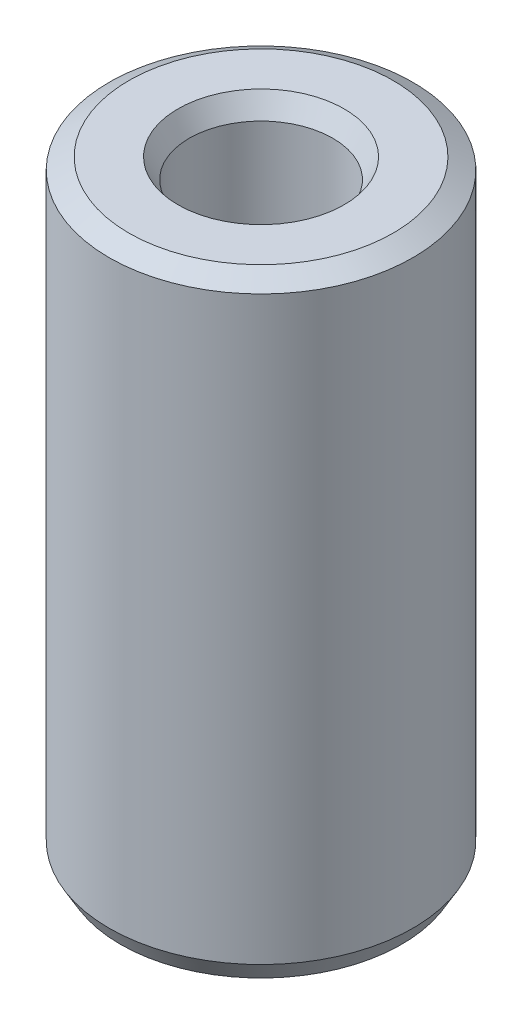
ISO-10303-21;
HEADER;
FILE_DESCRIPTION(('STEP AP214'),'2;1');
FILE_NAME('part.step','',(''),(''),'','','');
FILE_SCHEMA(('AUTOMOTIVE_DESIGN { 1 0 10303 214 1 1 1 1 }'));
ENDSEC;
DATA;
#1=APPLICATION_CONTEXT('core data for automotive mechanical design processes');
#2=APPLICATION_PROTOCOL_DEFINITION('international standard','automotive_design',2000,#1);
#3=PRODUCT_CONTEXT('',#1,'mechanical');
#4=PRODUCT('Part','Part','',(#3));
#5=PRODUCT_RELATED_PRODUCT_CATEGORY('part','',(#4));
#6=PRODUCT_DEFINITION_FORMATION('','',#4);
#7=PRODUCT_DEFINITION_CONTEXT('part definition',#1,'design');
#8=PRODUCT_DEFINITION('design','',#6,#7);
#9=PRODUCT_DEFINITION_SHAPE('','',#8);
#10=(LENGTH_UNIT() NAMED_UNIT(*) SI_UNIT(.MILLI.,.METRE.));
#11=(NAMED_UNIT(*) PLANE_ANGLE_UNIT() SI_UNIT($,.RADIAN.));
#12=(NAMED_UNIT(*) SI_UNIT($,.STERADIAN.) SOLID_ANGLE_UNIT());
#13=UNCERTAINTY_MEASURE_WITH_UNIT(LENGTH_MEASURE(1.E-05),#10,'distance_accuracy_value','');
#14=(GEOMETRIC_REPRESENTATION_CONTEXT(3) GLOBAL_UNCERTAINTY_ASSIGNED_CONTEXT((#13)) GLOBAL_UNIT_ASSIGNED_CONTEXT((#10,
#11,#12)) REPRESENTATION_CONTEXT('',''));
#15=CARTESIAN_POINT('',(0.,0.,0.));
#16=DIRECTION('',(0.,0.,1.));
#17=DIRECTION('',(1.,0.,0.));
#18=AXIS2_PLACEMENT_3D('',#15,#16,#17);
#19=CARTESIAN_POINT('',(0.,201.39709668376,0.));
#20=DIRECTION('',(0.,-1.,0.));
#21=DIRECTION('',(0.,0.,-1.));
#22=AXIS2_PLACEMENT_3D('',#19,#20,#21);
#23=CYLINDRICAL_SURFACE('',#22,50.);
#24=CARTESIAN_POINT('',(0.,6.49599250968244,0.));
#25=DIRECTION('',(0.,1.,0.));
#26=DIRECTION('',(0.,0.,1.));
#27=AXIS2_PLACEMENT_3D('',#24,#25,#26);
#28=CIRCLE('',#27,50.);
#29=CARTESIAN_POINT('',(0.,6.49599250968244,50.));
#30=VERTEX_POINT('',#29);
#31=EDGE_CURVE('E10',#30,#30,#28,.T.);
#32=ORIENTED_EDGE('',*,*,#31,.T.);
#33=EDGE_LOOP('',(#32));
#34=FACE_BOUND('',#33,.T.);
#35=CARTESIAN_POINT('',(0.,197.646633659641,0.));
#36=DIRECTION('',(0.,1.,0.));
#37=DIRECTION('',(0.,0.,1.));
#38=AXIS2_PLACEMENT_3D('',#35,#36,#37);
#39=CIRCLE('',#38,50.);
#40=CARTESIAN_POINT('',(0.,197.646633659641,50.));
#41=VERTEX_POINT('',#40);
#42=EDGE_CURVE('E50',#41,#41,#39,.F.);
#43=ORIENTED_EDGE('',*,*,#42,.T.);
#44=EDGE_LOOP('',(#43));
#45=FACE_BOUND('',#44,.T.);
#46=ADVANCED_FACE('F39',(#34,#45),#23,.T.);
#47=CARTESIAN_POINT('',(0.,201.39709668376,0.));
#48=DIRECTION('',(0.,1.,0.));
#49=DIRECTION('',(0.,0.,1.));
#50=AXIS2_PLACEMENT_3D('',#47,#48,#49);
#51=PLANE('',#50);
#52=CARTESIAN_POINT('',(0.,201.39709668376,0.));
#53=DIRECTION('',(0.,1.,0.));
#54=DIRECTION('',(0.,0.,1.));
#55=AXIS2_PLACEMENT_3D('',#52,#53,#54);
#56=CIRCLE('',#55,27.3605341539599);
#57=CARTESIAN_POINT('',(0.,201.39709668376,27.3605341539599));
#58=VERTEX_POINT('',#57);
#59=EDGE_CURVE('E58',#58,#58,#56,.F.);
#60=ORIENTED_EDGE('',*,*,#59,.T.);
#61=EDGE_LOOP('',(#60));
#62=FACE_BOUND('',#61,.T.);
#63=CARTESIAN_POINT('',(0.,201.39709668376,0.));
#64=DIRECTION('',(0.,1.,0.));
#65=DIRECTION('',(0.,0.,1.));
#66=AXIS2_PLACEMENT_3D('',#63,#64,#65);
#67=CIRCLE('',#66,43.5040074903174);
#68=CARTESIAN_POINT('',(0.,201.39709668376,43.5040074903174));
#69=VERTEX_POINT('',#68);
#70=EDGE_CURVE('E61',#69,#69,#67,.T.);
#71=ORIENTED_EDGE('',*,*,#70,.T.);
#72=EDGE_LOOP('',(#71));
#73=FACE_BOUND('',#72,.T.);
#74=ADVANCED_FACE('F88',(#62,#73),#51,.T.);
#75=CARTESIAN_POINT('',(0.,0.,0.));
#76=DIRECTION('',(0.,1.,0.));
#77=DIRECTION('',(0.,0.,1.));
#78=AXIS2_PLACEMENT_3D('',#75,#76,#77);
#79=PLANE('',#78);
#80=CARTESIAN_POINT('',(0.,0.,0.));
#81=DIRECTION('',(0.,1.,0.));
#82=DIRECTION('',(0.,0.,1.));
#83=AXIS2_PLACEMENT_3D('',#80,#81,#82);
#84=CIRCLE('',#83,30.1060636395233);
#85=CARTESIAN_POINT('',(0.,0.,-30.1060636395233));
#86=VERTEX_POINT('',#85);
#87=EDGE_CURVE('E51',#86,#86,#84,.T.);
#88=ORIENTED_EDGE('',*,*,#87,.T.);
#89=EDGE_LOOP('',(#88));
#90=FACE_BOUND('',#89,.T.);
#91=CARTESIAN_POINT('',(0.,0.,0.));
#92=DIRECTION('',(0.,1.,0.));
#93=DIRECTION('',(0.,0.,1.));
#94=AXIS2_PLACEMENT_3D('',#91,#92,#93);
#95=CIRCLE('',#94,46.249536975881);
#96=CARTESIAN_POINT('',(0.,0.,46.249536975881));
#97=VERTEX_POINT('',#96);
#98=EDGE_CURVE('E54',#97,#97,#95,.F.);
#99=ORIENTED_EDGE('',*,*,#98,.T.);
#100=EDGE_LOOP('',(#99));
#101=FACE_BOUND('',#100,.T.);
#102=ADVANCED_FACE('F83',(#90,#101),#79,.F.);
#103=CARTESIAN_POINT('',(0.,201.39709668376,0.));
#104=DIRECTION('',(0.,-1.,0.));
#105=DIRECTION('',(0.,0.,-1.));
#106=AXIS2_PLACEMENT_3D('',#103,#104,#105);
#107=CYLINDRICAL_SURFACE('',#106,23.6100711298409);
#108=CARTESIAN_POINT('',(0.,194.901104174077,0.));
#109=DIRECTION('',(0.,1.,0.));
#110=DIRECTION('',(0.,0.,1.));
#111=AXIS2_PLACEMENT_3D('',#108,#109,#110);
#112=CIRCLE('',#111,23.6100711298409);
#113=CARTESIAN_POINT('',(0.,194.901104174077,23.6100711298409));
#114=VERTEX_POINT('',#113);
#115=EDGE_CURVE('E67',#114,#114,#112,.T.);
#116=ORIENTED_EDGE('',*,*,#115,.T.);
#117=EDGE_LOOP('',(#116));
#118=FACE_BOUND('',#117,.T.);
#119=CARTESIAN_POINT('',(0.,3.75046302411899,0.));
#120=DIRECTION('',(0.,1.,0.));
#121=DIRECTION('',(0.,0.,1.));
#122=AXIS2_PLACEMENT_3D('',#119,#120,#121);
#123=CIRCLE('',#122,23.6100711298409);
#124=CARTESIAN_POINT('',(0.,3.75046302411899,-23.6100711298409));
#125=VERTEX_POINT('',#124);
#126=EDGE_CURVE('E69',#125,#125,#123,.F.);
#127=ORIENTED_EDGE('',*,*,#126,.T.);
#128=EDGE_LOOP('',(#127));
#129=FACE_BOUND('',#128,.T.);
#130=ADVANCED_FACE('F71',(#118,#129),#107,.F.);
#131=CARTESIAN_POINT('',(0.,194.901104174077,0.));
#132=DIRECTION('',(0.,1.,0.));
#133=DIRECTION('',(0.,0.,1.));
#134=AXIS2_PLACEMENT_3D('',#131,#132,#133);
#135=CONICAL_SURFACE('',#134,23.6100711298409,0.523598775598299);
#136=ORIENTED_EDGE('',*,*,#59,.F.);
#137=EDGE_LOOP('',(#136));
#138=FACE_BOUND('',#137,.T.);
#139=ORIENTED_EDGE('',*,*,#115,.F.);
#140=EDGE_LOOP('',(#139));
#141=FACE_BOUND('',#140,.T.);
#142=ADVANCED_FACE('F77',(#138,#141),#135,.F.);
#143=CARTESIAN_POINT('',(0.,0.,0.));
#144=DIRECTION('',(0.,-1.,0.));
#145=DIRECTION('',(0.,0.,-1.));
#146=AXIS2_PLACEMENT_3D('',#143,#144,#145);
#147=CONICAL_SURFACE('',#146,30.1060636395233,1.0471975511966);
#148=CARTESIAN_POINT('',(0.,3.75046302411899,-23.6100711298409));
#149=CARTESIAN_POINT('',(0.,3.71139570095109,-23.6777377184834));
#150=CARTESIAN_POINT('',(0.,3.67232837778318,-23.7454043071259));
#151=CARTESIAN_POINT('',(0.,3.59419373144737,-23.880737484411));
#152=CARTESIAN_POINT('',(0.,3.55512640827946,-23.9484040730535));
#153=CARTESIAN_POINT('',(0.,3.47699176194365,-24.0837372503385));
#154=CARTESIAN_POINT('',(0.,3.43792443877574,-24.1514038389811));
#155=CARTESIAN_POINT('',(0.,3.35978979243993,-24.2867370162661));
#156=CARTESIAN_POINT('',(0.,3.32072246927203,-24.3544036049086));
#157=CARTESIAN_POINT('',(0.,3.24258782293621,-24.4897367821937));
#158=CARTESIAN_POINT('',(0.,3.20352049976831,-24.5574033708362));
#159=CARTESIAN_POINT('',(0.,3.12538585343249,-24.6927365481213));
#160=CARTESIAN_POINT('',(0.,3.08631853026459,-24.7604031367638));
#161=CARTESIAN_POINT('',(0.,3.00818388392878,-24.8957363140488));
#162=CARTESIAN_POINT('',(0.,2.96911656076087,-24.9634029026914));
#163=CARTESIAN_POINT('',(0.,2.89098191442506,-25.0987360799764));
#164=CARTESIAN_POINT('',(0.,2.85191459125715,-25.166402668619));
#165=CARTESIAN_POINT('',(0.,2.77377994492134,-25.301735845904));
#166=CARTESIAN_POINT('',(0.,2.73471262175343,-25.3694024345465));
#167=CARTESIAN_POINT('',(0.,2.65657797541762,-25.5047356118316));
#168=CARTESIAN_POINT('',(0.,2.61751065224971,-25.5724022004741));
#169=CARTESIAN_POINT('',(0.,2.5393760059139,-25.7077353777592));
#170=CARTESIAN_POINT('',(0.,2.500308682746,-25.7754019664017));
#171=CARTESIAN_POINT('',(0.,2.42217403641018,-25.9107351436867));
#172=CARTESIAN_POINT('',(0.,2.38310671324228,-25.9784017323293));
#173=CARTESIAN_POINT('',(0.,2.30497206690646,-26.1137349096143));
#174=CARTESIAN_POINT('',(0.,2.26590474373856,-26.1814014982568));
#175=CARTESIAN_POINT('',(0.,2.18777009740275,-26.3167346755419));
#176=CARTESIAN_POINT('',(0.,2.14870277423484,-26.3844012641844));
#177=CARTESIAN_POINT('',(0.,2.07056812789903,-26.5197344414695));
#178=CARTESIAN_POINT('',(0.,2.03150080473112,-26.587401030112));
#179=CARTESIAN_POINT('',(0.,1.95336615839531,-26.722734207397));
#180=CARTESIAN_POINT('',(0.,1.9142988352274,-26.7904007960396));
#181=CARTESIAN_POINT('',(0.,1.83616418889159,-26.9257339733246));
#182=CARTESIAN_POINT('',(0.,1.79709686572368,-26.9934005619671));
#183=CARTESIAN_POINT('',(0.,1.71896221938787,-27.1287337392522));
#184=CARTESIAN_POINT('',(0.,1.67989489621997,-27.1964003278947));
#185=CARTESIAN_POINT('',(0.,1.60176024988415,-27.3317335051798));
#186=CARTESIAN_POINT('',(0.,1.56269292671625,-27.3994000938223));
#187=CARTESIAN_POINT('',(0.,1.48455828038043,-27.5347332711074));
#188=CARTESIAN_POINT('',(0.,1.44549095721253,-27.6023998597499));
#189=CARTESIAN_POINT('',(0.,1.36735631087672,-27.7377330370349));
#190=CARTESIAN_POINT('',(0.,1.32828898770881,-27.8053996256775));
#191=CARTESIAN_POINT('',(0.,1.250154341373,-27.9407328029625));
#192=CARTESIAN_POINT('',(0.,1.21108701820509,-28.008399391605));
#193=CARTESIAN_POINT('',(0.,1.13295237186928,-28.1437325688901));
#194=CARTESIAN_POINT('',(0.,1.09388504870137,-28.2113991575326));
#195=CARTESIAN_POINT('',(0.,1.01575040236556,-28.3467323348177));
#196=CARTESIAN_POINT('',(0.,0.976683079197655,-28.4143989234602));
#197=CARTESIAN_POINT('',(0.,0.898548432861842,-28.5497321007452));
#198=CARTESIAN_POINT('',(0.,0.859481109693936,-28.6173986893878));
#199=CARTESIAN_POINT('',(0.,0.781346463358124,-28.7527318666728));
#200=CARTESIAN_POINT('',(0.,0.742279140190217,-28.8203984553153));
#201=CARTESIAN_POINT('',(0.,0.664144493854405,-28.9557316326004));
#202=CARTESIAN_POINT('',(0.,0.625077170686499,-29.0233982212429));
#203=CARTESIAN_POINT('',(0.,0.546942524350686,-29.158731398528));
#204=CARTESIAN_POINT('',(0.,0.50787520118278,-29.2263979871705));
#205=CARTESIAN_POINT('',(0.,0.429740554846968,-29.3617311644556));
#206=CARTESIAN_POINT('',(0.,0.390673231679062,-29.4293977530981));
#207=CARTESIAN_POINT('',(0.,0.31253858534325,-29.5647309303831));
#208=CARTESIAN_POINT('',(0.,0.273471262175343,-29.6323975190257));
#209=CARTESIAN_POINT('',(0.,0.195336615839531,-29.7677306963107));
#210=CARTESIAN_POINT('',(0.,0.156269292671625,-29.8353972849532));
#211=CARTESIAN_POINT('',(0.,0.0781346463358124,-29.9707304622383));
#212=CARTESIAN_POINT('',(0.,0.0390673231679063,-30.0383970508808));
#213=CARTESIAN_POINT('',(0.,0.,-30.1060636395233));
#214=B_SPLINE_CURVE_WITH_KNOTS('',3,(#148,#149,#150,#151,#152,#153,#154,#155,#156,#157,#158,
#159,#160,#161,#162,#163,#164,#165,#166,#167,#168,#169,#170,#171,#172,#173,#174,#175,#176,#177,
#178,#179,#180,#181,#182,#183,#184,#185,#186,#187,#188,#189,#190,#191,#192,#193,#194,#195,#196,
#197,#198,#199,#200,#201,#202,#203,#204,#205,#206,#207,#208,#209,#210,#211,#212,#213),
.UNSPECIFIED.,.F.,.F.,(4,2,2,2,2,2,2,2,2,2,2,2,2,2,2,2,2,2,2,2,2,2,2,2,2,2,2,2,2,2,2,2,4),(0.,
0.234403939007436,0.468807878014872,0.703211817022308,0.937615756029746,1.17201969503718,
1.40642363404462,1.64082757305205,1.87523151205949,2.10963545106693,2.34403939007436,
2.5784433290818,2.81284726808924,3.04725120709667,3.28165514610411,3.51605908511154,
3.75046302411898,3.98486696312642,4.21927090213385,4.45367484114129,4.68807878014873,
4.92248271915616,5.1568866581636,5.39129059717103,5.62569453617847,5.86009847518591,
6.09450241419334,6.32890635320078,6.56331029220821,6.79771423121565,7.03211817022309,
7.26652210923052,7.50092604823796),.UNSPECIFIED.);
#215=EDGE_CURVE('BSEAM73',#125,#86,#214,.T.);
#216=ORIENTED_EDGE('',*,*,#126,.F.);
#217=ORIENTED_EDGE('',*,*,#87,.F.);
#218=ORIENTED_EDGE('',*,*,#215,.T.);
#219=ORIENTED_EDGE('',*,*,#215,.F.);
#220=EDGE_LOOP('',(#216,#218,#217,#219));
#221=FACE_BOUND('',#220,.T.);
#222=ADVANCED_FACE('F73',(#221),#147,.F.);
#223=CARTESIAN_POINT('',(0.,6.49599250968244,0.));
#224=DIRECTION('',(0.,1.,0.));
#225=DIRECTION('',(0.,0.,1.));
#226=AXIS2_PLACEMENT_3D('',#223,#224,#225);
#227=CONICAL_SURFACE('',#226,50.,0.523598775598302);
#228=CARTESIAN_POINT('',(0.,0.,46.249536975881));
#229=CARTESIAN_POINT('',(0.,0.0676665886425245,46.2886042990489));
#230=CARTESIAN_POINT('',(0.,0.13533317728505,46.3276716222168));
#231=CARTESIAN_POINT('',(0.,0.270666354570101,46.4058062685526));
#232=CARTESIAN_POINT('',(0.,0.338332943212626,46.4448735917206));
#233=CARTESIAN_POINT('',(0.,0.473666120497677,46.5230082380564));
#234=CARTESIAN_POINT('',(0.,0.541332709140203,46.5620755612243));
#235=CARTESIAN_POINT('',(0.,0.676665886425253,46.6402102075601));
#236=CARTESIAN_POINT('',(0.,0.744332475067779,46.679277530728));
#237=CARTESIAN_POINT('',(0.,0.87966565235283,46.7574121770638));
#238=CARTESIAN_POINT('',(0.,0.947332240995355,46.7964795002317));
#239=CARTESIAN_POINT('',(0.,1.08266541828041,46.8746141465675));
#240=CARTESIAN_POINT('',(0.,1.15033200692293,46.9136814697354));
#241=CARTESIAN_POINT('',(0.,1.28566518420798,46.9918161160712));
#242=CARTESIAN_POINT('',(0.,1.35333177285051,47.0308834392391));
#243=CARTESIAN_POINT('',(0.,1.48866495013556,47.109018085575));
#244=CARTESIAN_POINT('',(0.,1.55633153877809,47.1480854087429));
#245=CARTESIAN_POINT('',(0.,1.69166471606314,47.2262200550787));
#246=CARTESIAN_POINT('',(0.,1.75933130470566,47.2652873782466));
#247=CARTESIAN_POINT('',(0.,1.89466448199071,47.3434220245824));
#248=CARTESIAN_POINT('',(0.,1.96233107063324,47.3824893477503));
#249=CARTESIAN_POINT('',(0.,2.09766424791829,47.4606239940861));
#250=CARTESIAN_POINT('',(0.,2.16533083656081,47.499691317254));
#251=CARTESIAN_POINT('',(0.,2.30066401384586,47.5778259635898));
#252=CARTESIAN_POINT('',(0.,2.36833060248839,47.6168932867577));
#253=CARTESIAN_POINT('',(0.,2.50366377977344,47.6950279330935));
#254=CARTESIAN_POINT('',(0.,2.57133036841597,47.7340952562615));
#255=CARTESIAN_POINT('',(0.,2.70666354570102,47.8122299025973));
#256=CARTESIAN_POINT('',(0.,2.77433013434354,47.8512972257652));
#257=CARTESIAN_POINT('',(0.,2.90966331162859,47.929431872101));
#258=CARTESIAN_POINT('',(0.,2.97732990027112,47.9684991952689));
#259=CARTESIAN_POINT('',(0.,3.11266307755617,48.0466338416047));
#260=CARTESIAN_POINT('',(0.,3.18032966619869,48.0857011647726));
#261=CARTESIAN_POINT('',(0.,3.31566284348375,48.1638358111084));
#262=CARTESIAN_POINT('',(0.,3.38332943212627,48.2029031342763));
#263=CARTESIAN_POINT('',(0.,3.51866260941132,48.2810377806121));
#264=CARTESIAN_POINT('',(0.,3.58632919805385,48.32010510378));
#265=CARTESIAN_POINT('',(0.,3.7216623753389,48.3982397501159));
#266=CARTESIAN_POINT('',(0.,3.78932896398142,48.4373070732838));
#267=CARTESIAN_POINT('',(0.,3.92466214126648,48.5154417196196));
#268=CARTESIAN_POINT('',(0.,3.992328729909,48.5545090427875));
#269=CARTESIAN_POINT('',(0.,4.12766190719405,48.6326436891233));
#270=CARTESIAN_POINT('',(0.,4.19532849583658,48.6717110122912));
#271=CARTESIAN_POINT('',(0.,4.33066167312163,48.749845658627));
#272=CARTESIAN_POINT('',(0.,4.39832826176415,48.7889129817949));
#273=CARTESIAN_POINT('',(0.,4.5336614390492,48.8670476281307));
#274=CARTESIAN_POINT('',(0.,4.60132802769173,48.9061149512986));
#275=CARTESIAN_POINT('',(0.,4.73666120497678,48.9842495976344));
#276=CARTESIAN_POINT('',(0.,4.8043277936193,49.0233169208024));
#277=CARTESIAN_POINT('',(0.,4.93966097090436,49.1014515671382));
#278=CARTESIAN_POINT('',(0.,5.00732755954688,49.1405188903061));
#279=CARTESIAN_POINT('',(0.,5.14266073683193,49.2186535366419));
#280=CARTESIAN_POINT('',(0.,5.21032732547446,49.2577208598098));
#281=CARTESIAN_POINT('',(0.,5.34566050275951,49.3358555061456));
#282=CARTESIAN_POINT('',(0.,5.41332709140203,49.3749228293135));
#283=CARTESIAN_POINT('',(0.,5.54866026868708,49.4530574756493));
#284=CARTESIAN_POINT('',(0.,5.61632685732961,49.4921247988172));
#285=CARTESIAN_POINT('',(0.,5.75166003461466,49.570259445153));
#286=CARTESIAN_POINT('',(0.,5.81932662325719,49.6093267683209));
#287=CARTESIAN_POINT('',(0.,5.95465980054224,49.6874614146568));
#288=CARTESIAN_POINT('',(0.,6.02232638918476,49.7265287378247));
#289=CARTESIAN_POINT('',(0.,6.15765956646981,49.8046633841605));
#290=CARTESIAN_POINT('',(0.,6.22532615511234,49.8437307073284));
#291=CARTESIAN_POINT('',(0.,6.36065933239739,49.9218653536642));
#292=CARTESIAN_POINT('',(0.,6.42832592103992,49.9609326768321));
#293=CARTESIAN_POINT('',(0.,6.49599250968244,50.));
#294=B_SPLINE_CURVE_WITH_KNOTS('',3,(#228,#229,#230,#231,#232,#233,#234,#235,#236,#237,#238,
#239,#240,#241,#242,#243,#244,#245,#246,#247,#248,#249,#250,#251,#252,#253,#254,#255,#256,#257,
#258,#259,#260,#261,#262,#263,#264,#265,#266,#267,#268,#269,#270,#271,#272,#273,#274,#275,#276,
#277,#278,#279,#280,#281,#282,#283,#284,#285,#286,#287,#288,#289,#290,#291,#292,#293),
.UNSPECIFIED.,.F.,.F.,(4,2,2,2,2,2,2,2,2,2,2,2,2,2,2,2,2,2,2,2,2,2,2,2,2,2,2,2,2,2,2,2,4),(0.,
0.234403939007435,0.468807878014869,0.703211817022304,0.937615756029739,1.17201969503717,
1.40642363404461,1.64082757305204,1.87523151205948,2.10963545106692,2.34403939007435,
2.57844332908178,2.81284726808922,3.04725120709665,3.28165514610409,3.51605908511152,
3.75046302411896,3.98486696312639,4.21927090213383,4.45367484114126,4.6880787801487,
4.92248271915613,5.15688665816357,5.391290597171,5.62569453617844,5.86009847518587,
6.09450241419331,6.32890635320074,6.56331029220818,6.79771423121561,7.03211817022305,
7.26652210923048,7.50092604823791),.UNSPECIFIED.);
#295=EDGE_CURVE('BSEAM76',#97,#30,#294,.T.);
#296=ORIENTED_EDGE('',*,*,#98,.F.);
#297=ORIENTED_EDGE('',*,*,#31,.F.);
#298=ORIENTED_EDGE('',*,*,#295,.T.);
#299=ORIENTED_EDGE('',*,*,#295,.F.);
#300=EDGE_LOOP('',(#296,#298,#297,#299));
#301=FACE_BOUND('',#300,.T.);
#302=ADVANCED_FACE('F76',(#301),#227,.T.);
#303=CARTESIAN_POINT('',(0.,201.39709668376,0.));
#304=DIRECTION('',(0.,-1.,0.));
#305=DIRECTION('',(0.,0.,-1.));
#306=AXIS2_PLACEMENT_3D('',#303,#304,#305);
#307=CONICAL_SURFACE('',#306,43.5040074903174,1.0471975511966);
#308=ORIENTED_EDGE('',*,*,#42,.F.);
#309=EDGE_LOOP('',(#308));
#310=FACE_BOUND('',#309,.T.);
#311=ORIENTED_EDGE('',*,*,#70,.F.);
#312=EDGE_LOOP('',(#311));
#313=FACE_BOUND('',#312,.T.);
#314=ADVANCED_FACE('F45',(#310,#313),#307,.T.);
#315=CLOSED_SHELL('',(#46,#74,#102,#130,#142,#222,#302,#314));
#316=MANIFOLD_SOLID_BREP('B2',#315);
#317=ADVANCED_BREP_SHAPE_REPRESENTATION('',(#18,#316),#14);
#318=SHAPE_DEFINITION_REPRESENTATION(#9,#317);
ENDSEC;
END-ISO-10303-21;
